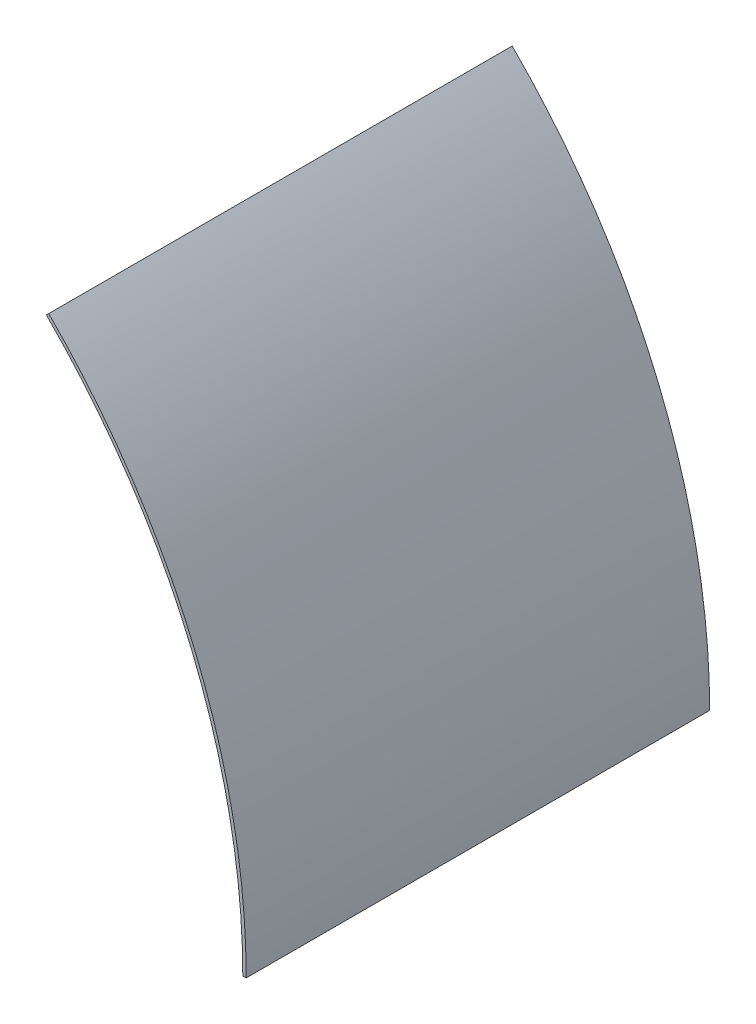
ISO-10303-21;
HEADER;
FILE_DESCRIPTION(('STEP AP214'),'2;1');
FILE_NAME('part.step','',(''),(''),'','','');
FILE_SCHEMA(('AUTOMOTIVE_DESIGN { 1 0 10303 214 1 1 1 1 }'));
ENDSEC;
DATA;
#1=APPLICATION_CONTEXT('core data for automotive mechanical design processes');
#2=APPLICATION_PROTOCOL_DEFINITION('international standard','automotive_design',2000,#1);
#3=PRODUCT_CONTEXT('',#1,'mechanical');
#4=PRODUCT('Part','Part','',(#3));
#5=PRODUCT_RELATED_PRODUCT_CATEGORY('part','',(#4));
#6=PRODUCT_DEFINITION_FORMATION('','',#4);
#7=PRODUCT_DEFINITION_CONTEXT('part definition',#1,'design');
#8=PRODUCT_DEFINITION('design','',#6,#7);
#9=PRODUCT_DEFINITION_SHAPE('','',#8);
#10=(LENGTH_UNIT() NAMED_UNIT(*) SI_UNIT(.MILLI.,.METRE.));
#11=(NAMED_UNIT(*) PLANE_ANGLE_UNIT() SI_UNIT($,.RADIAN.));
#12=(NAMED_UNIT(*) SI_UNIT($,.STERADIAN.) SOLID_ANGLE_UNIT());
#13=UNCERTAINTY_MEASURE_WITH_UNIT(LENGTH_MEASURE(1.E-05),#10,'distance_accuracy_value','');
#14=(GEOMETRIC_REPRESENTATION_CONTEXT(3) GLOBAL_UNCERTAINTY_ASSIGNED_CONTEXT((#13)) GLOBAL_UNIT_ASSIGNED_CONTEXT((#10,
#11,#12)) REPRESENTATION_CONTEXT('',''));
#15=CARTESIAN_POINT('',(0.,0.,0.));
#16=DIRECTION('',(0.,0.,1.));
#17=DIRECTION('',(1.,0.,0.));
#18=AXIS2_PLACEMENT_3D('',#15,#16,#17);
#19=CARTESIAN_POINT('',(0.,0.,174.625));
#20=DIRECTION('',(0.,0.,-1.));
#21=DIRECTION('',(-1.,0.,0.));
#22=AXIS2_PLACEMENT_3D('',#19,#20,#21);
#23=CYLINDRICAL_SURFACE('',#22,254.);
#24=CARTESIAN_POINT('',(0.,0.,0.));
#25=DIRECTION('',(0.,0.,1.));
#26=DIRECTION('',(-1.,0.,0.));
#27=AXIS2_PLACEMENT_3D('',#24,#25,#26);
#28=CIRCLE('',#27,254.);
#29=CARTESIAN_POINT('',(254.,0.,0.));
#30=VERTEX_POINT('',#29);
#31=CARTESIAN_POINT('',(179.605122421383,179.605122421383,0.));
#32=VERTEX_POINT('',#31);
#33=EDGE_CURVE('E102',#30,#32,#28,.T.);
#34=ORIENTED_EDGE('',*,*,#33,.T.);
#35=DIRECTION('',(0.,0.,-1.));
#36=VECTOR('',#35,1.);
#37=CARTESIAN_POINT('',(179.605122421383,179.605122421383,174.625));
#38=LINE('',#37,#36);
#39=CARTESIAN_POINT('',(179.605122421383,179.605122421383,174.625));
#40=VERTEX_POINT('',#39);
#41=EDGE_CURVE('E11',#40,#32,#38,.T.);
#42=ORIENTED_EDGE('',*,*,#41,.F.);
#43=CARTESIAN_POINT('',(0.,0.,174.625));
#44=DIRECTION('',(0.,0.,1.));
#45=DIRECTION('',(-1.,0.,0.));
#46=AXIS2_PLACEMENT_3D('',#43,#44,#45);
#47=CIRCLE('',#46,254.);
#48=CARTESIAN_POINT('',(254.,0.,174.625));
#49=VERTEX_POINT('',#48);
#50=EDGE_CURVE('E90',#49,#40,#47,.T.);
#51=ORIENTED_EDGE('',*,*,#50,.F.);
#52=DIRECTION('',(0.,0.,-1.));
#53=VECTOR('',#52,1.);
#54=CARTESIAN_POINT('',(254.,0.,174.625));
#55=LINE('',#54,#53);
#56=EDGE_CURVE('E98',#49,#30,#55,.T.);
#57=ORIENTED_EDGE('',*,*,#56,.T.);
#58=EDGE_LOOP('',(#34,#42,#51,#57));
#59=FACE_BOUND('',#58,.T.);
#60=ADVANCED_FACE('F39',(#59),#23,.T.);
#61=CARTESIAN_POINT('',(179.605122421383,179.605122421383,174.625));
#62=DIRECTION('',(0.707106781186547,-0.707106781186547,0.));
#63=DIRECTION('',(0.707106781186548,0.707106781186548,0.));
#64=AXIS2_PLACEMENT_3D('',#61,#62,#63);
#65=PLANE('',#64);
#66=DIRECTION('',(-0.707106781186548,-0.707106781186548,0.));
#67=VECTOR('',#66,1.);
#68=CARTESIAN_POINT('',(179.605122421383,179.605122421383,0.));
#69=LINE('',#68,#67);
#70=CARTESIAN_POINT('',(178.707096809276,178.707096809276,0.));
#71=VERTEX_POINT('',#70);
#72=EDGE_CURVE('E94',#32,#71,#69,.T.);
#73=ORIENTED_EDGE('',*,*,#72,.T.);
#74=DIRECTION('',(0.,0.,-1.));
#75=VECTOR('',#74,1.);
#76=CARTESIAN_POINT('',(178.707096809276,178.707096809276,174.625));
#77=LINE('',#76,#75);
#78=CARTESIAN_POINT('',(178.707096809276,178.707096809276,174.625));
#79=VERTEX_POINT('',#78);
#80=EDGE_CURVE('E47',#79,#71,#77,.T.);
#81=ORIENTED_EDGE('',*,*,#80,.F.);
#82=DIRECTION('',(-0.707106781186548,-0.707106781186548,0.));
#83=VECTOR('',#82,1.);
#84=CARTESIAN_POINT('',(179.605122421383,179.605122421383,174.625));
#85=LINE('',#84,#83);
#86=EDGE_CURVE('E85',#40,#79,#85,.T.);
#87=ORIENTED_EDGE('',*,*,#86,.F.);
#88=ORIENTED_EDGE('',*,*,#41,.T.);
#89=EDGE_LOOP('',(#73,#81,#87,#88));
#90=FACE_BOUND('',#89,.T.);
#91=ADVANCED_FACE('F93',(#90),#65,.F.);
#92=CARTESIAN_POINT('',(0.,0.,174.625));
#93=DIRECTION('',(0.,0.,-1.));
#94=DIRECTION('',(-1.,0.,0.));
#95=AXIS2_PLACEMENT_3D('',#92,#93,#94);
#96=CYLINDRICAL_SURFACE('',#95,252.73);
#97=CARTESIAN_POINT('',(0.,0.,0.));
#98=DIRECTION('',(0.,0.,-1.));
#99=DIRECTION('',(-1.,0.,0.));
#100=AXIS2_PLACEMENT_3D('',#97,#98,#99);
#101=CIRCLE('',#100,252.73);
#102=CARTESIAN_POINT('',(252.73,0.,0.));
#103=VERTEX_POINT('',#102);
#104=EDGE_CURVE('E72',#71,#103,#101,.T.);
#105=ORIENTED_EDGE('',*,*,#104,.T.);
#106=DIRECTION('',(0.,0.,-1.));
#107=VECTOR('',#106,1.);
#108=CARTESIAN_POINT('',(252.73,0.,174.625));
#109=LINE('',#108,#107);
#110=CARTESIAN_POINT('',(252.73,0.,174.625));
#111=VERTEX_POINT('',#110);
#112=EDGE_CURVE('E95',#111,#103,#109,.T.);
#113=ORIENTED_EDGE('',*,*,#112,.F.);
#114=CARTESIAN_POINT('',(0.,0.,174.625));
#115=DIRECTION('',(0.,0.,-1.));
#116=DIRECTION('',(-1.,0.,0.));
#117=AXIS2_PLACEMENT_3D('',#114,#115,#116);
#118=CIRCLE('',#117,252.73);
#119=EDGE_CURVE('E88',#79,#111,#118,.T.);
#120=ORIENTED_EDGE('',*,*,#119,.F.);
#121=ORIENTED_EDGE('',*,*,#80,.T.);
#122=EDGE_LOOP('',(#105,#113,#120,#121));
#123=FACE_BOUND('',#122,.T.);
#124=ADVANCED_FACE('F96',(#123),#96,.F.);
#125=CARTESIAN_POINT('',(254.,0.,174.625));
#126=DIRECTION('',(0.,1.,0.));
#127=DIRECTION('',(-1.,0.,0.));
#128=AXIS2_PLACEMENT_3D('',#125,#126,#127);
#129=PLANE('',#128);
#130=DIRECTION('',(1.,0.,0.));
#131=VECTOR('',#130,1.);
#132=CARTESIAN_POINT('',(254.,0.,0.));
#133=LINE('',#132,#131);
#134=EDGE_CURVE('E78',#103,#30,#133,.T.);
#135=ORIENTED_EDGE('',*,*,#134,.T.);
#136=ORIENTED_EDGE('',*,*,#56,.F.);
#137=DIRECTION('',(1.,0.,0.));
#138=VECTOR('',#137,1.);
#139=CARTESIAN_POINT('',(254.,0.,174.625));
#140=LINE('',#139,#138);
#141=EDGE_CURVE('E55',#111,#49,#140,.T.);
#142=ORIENTED_EDGE('',*,*,#141,.F.);
#143=ORIENTED_EDGE('',*,*,#112,.T.);
#144=EDGE_LOOP('',(#135,#136,#142,#143));
#145=FACE_BOUND('',#144,.T.);
#146=ADVANCED_FACE('F109',(#145),#129,.F.);
#147=CARTESIAN_POINT('',(0.,0.,174.625));
#148=DIRECTION('',(0.,0.,-1.));
#149=DIRECTION('',(-1.,0.,0.));
#150=AXIS2_PLACEMENT_3D('',#147,#148,#149);
#151=PLANE('',#150);
#152=ORIENTED_EDGE('',*,*,#50,.T.);
#153=ORIENTED_EDGE('',*,*,#86,.T.);
#154=ORIENTED_EDGE('',*,*,#119,.T.);
#155=ORIENTED_EDGE('',*,*,#141,.T.);
#156=EDGE_LOOP('',(#152,#153,#154,#155));
#157=FACE_BOUND('',#156,.T.);
#158=ADVANCED_FACE('F86',(#157),#151,.F.);
#159=CARTESIAN_POINT('',(0.,0.,0.));
#160=DIRECTION('',(0.,0.,-1.));
#161=DIRECTION('',(-1.,0.,0.));
#162=AXIS2_PLACEMENT_3D('',#159,#160,#161);
#163=PLANE('',#162);
#164=ORIENTED_EDGE('',*,*,#33,.F.);
#165=ORIENTED_EDGE('',*,*,#134,.F.);
#166=ORIENTED_EDGE('',*,*,#104,.F.);
#167=ORIENTED_EDGE('',*,*,#72,.F.);
#168=EDGE_LOOP('',(#164,#165,#166,#167));
#169=FACE_BOUND('',#168,.T.);
#170=ADVANCED_FACE('F112',(#169),#163,.T.);
#171=CLOSED_SHELL('',(#60,#91,#124,#146,#158,#170));
#172=MANIFOLD_SOLID_BREP('B2',#171);
#173=ADVANCED_BREP_SHAPE_REPRESENTATION('',(#18,#172),#14);
#174=SHAPE_DEFINITION_REPRESENTATION(#9,#173);
ENDSEC;
END-ISO-10303-21;
